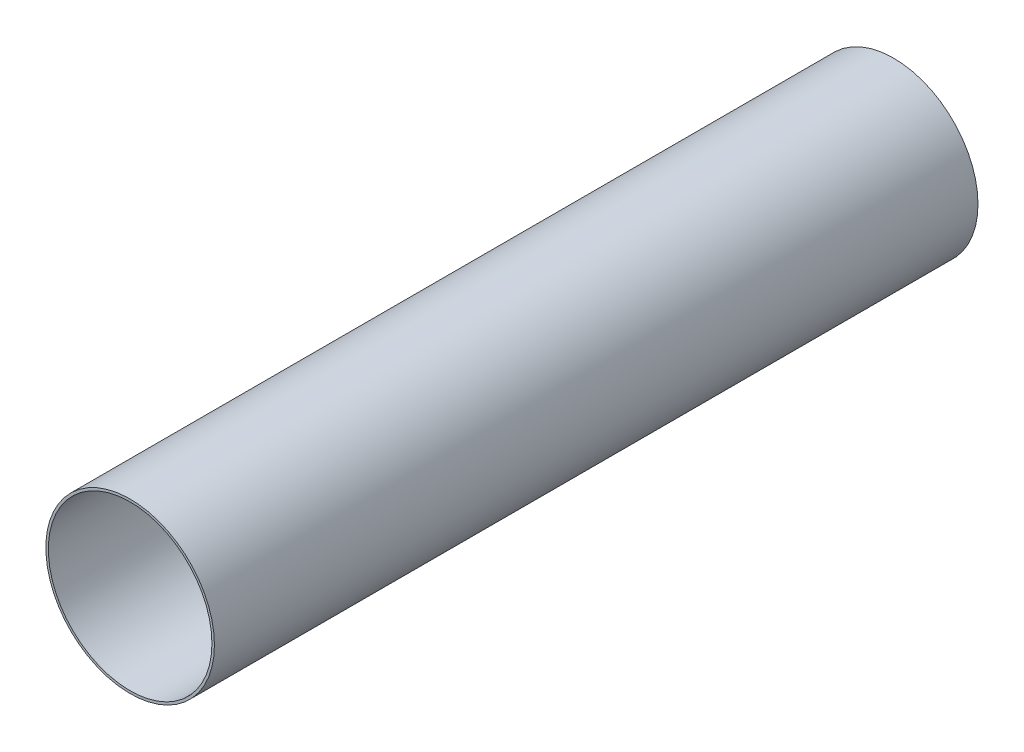
ISO-10303-21;
HEADER;
FILE_DESCRIPTION(('STEP AP214'),'2;1');
FILE_NAME('part.step','',(''),(''),'','','');
FILE_SCHEMA(('AUTOMOTIVE_DESIGN { 1 0 10303 214 1 1 1 1 }'));
ENDSEC;
DATA;
#1=APPLICATION_CONTEXT('core data for automotive mechanical design processes');
#2=APPLICATION_PROTOCOL_DEFINITION('international standard','automotive_design',2000,#1);
#3=PRODUCT_CONTEXT('',#1,'mechanical');
#4=PRODUCT('Part','Part','',(#3));
#5=PRODUCT_RELATED_PRODUCT_CATEGORY('part','',(#4));
#6=PRODUCT_DEFINITION_FORMATION('','',#4);
#7=PRODUCT_DEFINITION_CONTEXT('part definition',#1,'design');
#8=PRODUCT_DEFINITION('design','',#6,#7);
#9=PRODUCT_DEFINITION_SHAPE('','',#8);
#10=(LENGTH_UNIT() NAMED_UNIT(*) SI_UNIT(.MILLI.,.METRE.));
#11=(NAMED_UNIT(*) PLANE_ANGLE_UNIT() SI_UNIT($,.RADIAN.));
#12=(NAMED_UNIT(*) SI_UNIT($,.STERADIAN.) SOLID_ANGLE_UNIT());
#13=UNCERTAINTY_MEASURE_WITH_UNIT(LENGTH_MEASURE(1.E-05),#10,'distance_accuracy_value','');
#14=(GEOMETRIC_REPRESENTATION_CONTEXT(3) GLOBAL_UNCERTAINTY_ASSIGNED_CONTEXT((#13)) GLOBAL_UNIT_ASSIGNED_CONTEXT((#10,
#11,#12)) REPRESENTATION_CONTEXT('',''));
#15=CARTESIAN_POINT('',(0.,0.,0.));
#16=DIRECTION('',(0.,0.,1.));
#17=DIRECTION('',(1.,0.,0.));
#18=AXIS2_PLACEMENT_3D('',#15,#16,#17);
#19=CARTESIAN_POINT('',(0.,0.,177.8));
#20=DIRECTION('',(0.,0.,1.));
#21=DIRECTION('',(1.,0.,0.));
#22=AXIS2_PLACEMENT_3D('',#19,#20,#21);
#23=PLANE('',#22);
#24=CARTESIAN_POINT('',(0.,0.,177.8));
#25=DIRECTION('',(0.,0.,1.));
#26=DIRECTION('',(1.,0.,0.));
#27=AXIS2_PLACEMENT_3D('',#24,#25,#26);
#28=CIRCLE('',#27,39.2557);
#29=CARTESIAN_POINT('',(39.2557,0.,177.8));
#30=VERTEX_POINT('',#29);
#31=EDGE_CURVE('E10',#30,#30,#28,.T.);
#32=ORIENTED_EDGE('',*,*,#31,.T.);
#33=EDGE_LOOP('',(#32));
#34=FACE_BOUND('',#33,.T.);
#35=CARTESIAN_POINT('',(0.,0.,177.8));
#36=DIRECTION('',(0.,0.,1.));
#37=DIRECTION('',(1.,0.,0.));
#38=AXIS2_PLACEMENT_3D('',#35,#36,#37);
#39=CIRCLE('',#38,38.1);
#40=CARTESIAN_POINT('',(38.1,0.,177.8));
#41=VERTEX_POINT('',#40);
#42=EDGE_CURVE('E60',#41,#41,#39,.T.);
#43=ORIENTED_EDGE('',*,*,#42,.F.);
#44=EDGE_LOOP('',(#43));
#45=FACE_BOUND('',#44,.T.);
#46=ADVANCED_FACE('F49',(#34,#45),#23,.T.);
#47=CARTESIAN_POINT('',(0.,0.,-177.8));
#48=DIRECTION('',(0.,0.,1.));
#49=DIRECTION('',(1.,0.,0.));
#50=AXIS2_PLACEMENT_3D('',#47,#48,#49);
#51=PLANE('',#50);
#52=CARTESIAN_POINT('',(0.,0.,-177.8));
#53=DIRECTION('',(0.,0.,1.));
#54=DIRECTION('',(1.,0.,0.));
#55=AXIS2_PLACEMENT_3D('',#52,#53,#54);
#56=CIRCLE('',#55,39.2557);
#57=CARTESIAN_POINT('',(39.2557,0.,-177.8));
#58=VERTEX_POINT('',#57);
#59=EDGE_CURVE('E53',#58,#58,#56,.T.);
#60=ORIENTED_EDGE('',*,*,#59,.F.);
#61=EDGE_LOOP('',(#60));
#62=FACE_BOUND('',#61,.T.);
#63=CARTESIAN_POINT('',(0.,0.,-177.8));
#64=DIRECTION('',(0.,0.,1.));
#65=DIRECTION('',(1.,0.,0.));
#66=AXIS2_PLACEMENT_3D('',#63,#64,#65);
#67=CIRCLE('',#66,38.1);
#68=CARTESIAN_POINT('',(38.1,0.,-177.8));
#69=VERTEX_POINT('',#68);
#70=EDGE_CURVE('E62',#69,#69,#67,.T.);
#71=ORIENTED_EDGE('',*,*,#70,.T.);
#72=EDGE_LOOP('',(#71));
#73=FACE_BOUND('',#72,.T.);
#74=ADVANCED_FACE('F72',(#62,#73),#51,.F.);
#75=CARTESIAN_POINT('',(0.,0.,177.8));
#76=DIRECTION('',(0.,0.,-1.));
#77=DIRECTION('',(-1.,0.,0.));
#78=AXIS2_PLACEMENT_3D('',#75,#76,#77);
#79=CYLINDRICAL_SURFACE('',#78,39.2557);
#80=ORIENTED_EDGE('',*,*,#31,.F.);
#81=EDGE_LOOP('',(#80));
#82=FACE_BOUND('',#81,.T.);
#83=ORIENTED_EDGE('',*,*,#59,.T.);
#84=EDGE_LOOP('',(#83));
#85=FACE_BOUND('',#84,.T.);
#86=ADVANCED_FACE('F51',(#82,#85),#79,.T.);
#87=CARTESIAN_POINT('',(0.,0.,177.8));
#88=DIRECTION('',(0.,0.,-1.));
#89=DIRECTION('',(-1.,0.,0.));
#90=AXIS2_PLACEMENT_3D('',#87,#88,#89);
#91=CYLINDRICAL_SURFACE('',#90,38.1);
#92=ORIENTED_EDGE('',*,*,#42,.T.);
#93=EDGE_LOOP('',(#92));
#94=FACE_BOUND('',#93,.T.);
#95=ORIENTED_EDGE('',*,*,#70,.F.);
#96=EDGE_LOOP('',(#95));
#97=FACE_BOUND('',#96,.T.);
#98=ADVANCED_FACE('F68',(#94,#97),#91,.F.);
#99=CLOSED_SHELL('',(#46,#74,#86,#98));
#100=MANIFOLD_SOLID_BREP('B2',#99);
#101=ADVANCED_BREP_SHAPE_REPRESENTATION('',(#18,#100),#14);
#102=SHAPE_DEFINITION_REPRESENTATION(#9,#101);
ENDSEC;
END-ISO-10303-21;
